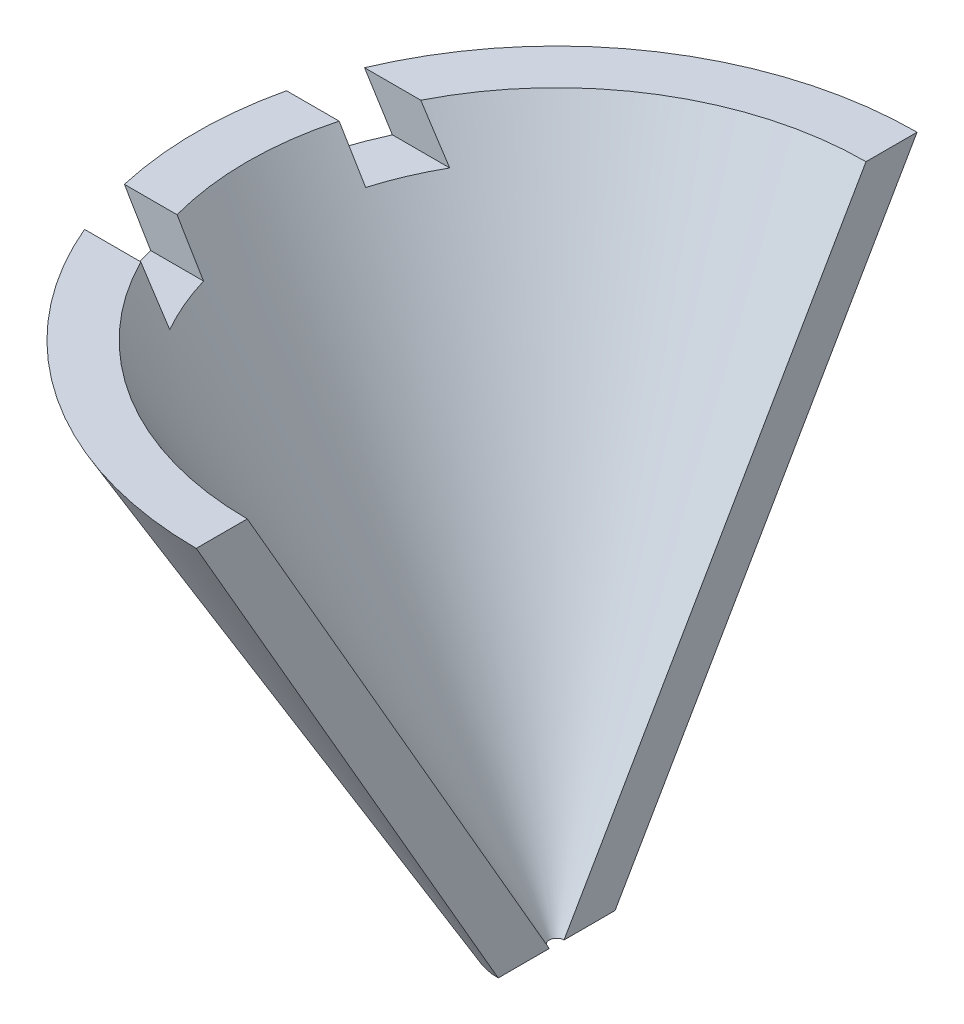
ISO-10303-21;
HEADER;
FILE_DESCRIPTION(('STEP AP214'),'2;1');
FILE_NAME('part.step','',(''),(''),'','','');
FILE_SCHEMA(('AUTOMOTIVE_DESIGN { 1 0 10303 214 1 1 1 1 }'));
ENDSEC;
DATA;
#1=APPLICATION_CONTEXT('core data for automotive mechanical design processes');
#2=APPLICATION_PROTOCOL_DEFINITION('international standard','automotive_design',2000,#1);
#3=PRODUCT_CONTEXT('',#1,'mechanical');
#4=PRODUCT('Part','Part','',(#3));
#5=PRODUCT_RELATED_PRODUCT_CATEGORY('part','',(#4));
#6=PRODUCT_DEFINITION_FORMATION('','',#4);
#7=PRODUCT_DEFINITION_CONTEXT('part definition',#1,'design');
#8=PRODUCT_DEFINITION('design','',#6,#7);
#9=PRODUCT_DEFINITION_SHAPE('','',#8);
#10=(LENGTH_UNIT() NAMED_UNIT(*) SI_UNIT(.MILLI.,.METRE.));
#11=(NAMED_UNIT(*) PLANE_ANGLE_UNIT() SI_UNIT($,.RADIAN.));
#12=(NAMED_UNIT(*) SI_UNIT($,.STERADIAN.) SOLID_ANGLE_UNIT());
#13=UNCERTAINTY_MEASURE_WITH_UNIT(LENGTH_MEASURE(1.E-05),#10,'distance_accuracy_value','');
#14=(GEOMETRIC_REPRESENTATION_CONTEXT(3) GLOBAL_UNCERTAINTY_ASSIGNED_CONTEXT((#13)) GLOBAL_UNIT_ASSIGNED_CONTEXT((#10,
#11,#12)) REPRESENTATION_CONTEXT('',''));
#15=CARTESIAN_POINT('',(0.,0.,0.));
#16=DIRECTION('',(0.,0.,1.));
#17=DIRECTION('',(1.,0.,0.));
#18=AXIS2_PLACEMENT_3D('',#15,#16,#17);
#19=CARTESIAN_POINT('',(0.,4.3242755837667,0.));
#20=DIRECTION('',(0.,1.,0.));
#21=DIRECTION('',(0.,0.,1.));
#22=AXIS2_PLACEMENT_3D('',#19,#20,#21);
#23=CONICAL_SURFACE('',#22,12.2286724799067,0.523598775598304);
#24=CARTESIAN_POINT('',(0.,2.8242755837667,0.));
#25=DIRECTION('',(0.,-1.,0.));
#26=DIRECTION('',(1.,0.,0.));
#27=AXIS2_PLACEMENT_3D('',#24,#25,#26);
#28=CIRCLE('',#27,11.3626470761223);
#29=CARTESIAN_POINT('',(-10.3221726674431,2.8242755837667,-4.75));
#30=VERTEX_POINT('',#29);
#31=CARTESIAN_POINT('',(-11.0248468731548,2.8242755837667,-2.75));
#32=VERTEX_POINT('',#31);
#33=EDGE_CURVE('E250',#30,#32,#28,.F.);
#34=ORIENTED_EDGE('',*,*,#33,.F.);
#35=CARTESIAN_POINT('',(-4.20431558511754,-5.86930909055491,-4.75));
#36=CARTESIAN_POINT('',(-4.32081574089658,-5.73552940085773,-4.75));
#37=CARTESIAN_POINT('',(-4.43580348199884,-5.60044924680136,-4.75));
#38=CARTESIAN_POINT('',(-4.66313925783365,-5.32810865166679,-4.75));
#39=CARTESIAN_POINT('',(-4.77548758327553,-5.19084845351965,-4.75));
#40=CARTESIAN_POINT('',(-4.99791169374271,-4.91459273273932,-4.75));
#41=CARTESIAN_POINT('',(-5.10798835158957,-4.77559791081223,-4.75));
#42=CARTESIAN_POINT('',(-5.32621853125392,-4.49610170065007,-4.75));
#43=CARTESIAN_POINT('',(-5.43437199157524,-4.35560026446896,-4.75));
#44=CARTESIAN_POINT('',(-5.75614417254973,-3.93245730068457,-4.75));
#45=CARTESIAN_POINT('',(-5.96727639580345,-3.64792444083813,-4.75));
#46=CARTESIAN_POINT('',(-6.38446998794349,-3.07513271587884,-4.75));
#47=CARTESIAN_POINT('',(-6.59053075865242,-2.786873417291,-4.75));
#48=CARTESIAN_POINT('',(-6.99837359501134,-2.20791442414484,-4.75));
#49=CARTESIAN_POINT('',(-7.20016092223666,-1.9172184298167,-4.75));
#50=CARTESIAN_POINT('',(-7.60052053405288,-1.3336425725848,-4.75));
#51=CARTESIAN_POINT('',(-7.79909294978434,-1.04076279947572,-4.75));
#52=CARTESIAN_POINT('',(-8.19366770777785,-0.453186386894623,-4.75));
#53=CARTESIAN_POINT('',(-8.38966947882686,-0.158489364310897,-4.75));
#54=CARTESIAN_POINT('',(-8.77951471873063,0.432330559583932,-4.75));
#55=CARTESIAN_POINT('',(-8.97335817180553,0.728453471297333,-4.75));
#56=CARTESIAN_POINT('',(-9.31265360256552,1.25023520797768,-4.75));
#57=CARTESIAN_POINT('',(-9.45848935444884,1.47564475706437,-4.75));
#58=CARTESIAN_POINT('',(-9.74923667184191,1.92704066509266,-4.75));
#59=CARTESIAN_POINT('',(-9.89414828999312,2.15302699013377,-4.75));
#60=CARTESIAN_POINT('',(-10.1831971209196,2.6055702038378,-4.75));
#61=CARTESIAN_POINT('',(-10.3273341403898,2.83212721592652,-4.75));
#62=CARTESIAN_POINT('',(-10.6148888500523,3.28570273181074,-4.75));
#63=CARTESIAN_POINT('',(-10.7583065274207,3.51272124373279,-4.75));
#64=CARTESIAN_POINT('',(-11.421258578074,4.56537830728143,-4.75));
#65=CARTESIAN_POINT('',(-11.936916938838,5.39345886802585,-4.75));
#66=CARTESIAN_POINT('',(-12.962502480222,7.05316128857481,-4.75));
#67=CARTESIAN_POINT('',(-13.4724296053369,7.88478318256857,-4.75));
#68=CARTESIAN_POINT('',(-14.4877456804525,9.54987896527475,-4.75));
#69=CARTESIAN_POINT('',(-14.9931379341389,10.3833508405818,-4.75));
#70=CARTESIAN_POINT('',(-15.7489169950837,11.6349334398041,-4.75));
#71=CARTESIAN_POINT('',(-16.0004545775747,12.0523502839229,-4.75));
#72=CARTESIAN_POINT('',(-16.5028547360984,12.8875890664591,-4.75));
#73=CARTESIAN_POINT('',(-16.7537173132692,13.305411004192,-4.75));
#74=CARTESIAN_POINT('',(-17.004288868676,13.7234074660923,-4.75));
#75=B_SPLINE_CURVE_WITH_KNOTS('',3,(#35,#36,#37,#38,#39,#40,#41,#42,#43,#44,#45,#46,#47,#48,#49,
#50,#51,#52,#53,#54,#55,#56,#57,#58,#59,#60,#61,#62,#63,#64,#65,#66,#67,#68,#69,#70,#71,#72,#73,
#74),.UNSPECIFIED.,.F.,.F.,(4,2,2,2,2,2,2,2,2,2,2,2,2,2,2,2,2,2,2,4),(0.,0.532158225419713,
1.06425756067756,1.59614849577501,2.12805640814335,3.19090257596317,4.25387351135788,
5.31544908501755,6.37698124592056,7.43874542020339,8.50051735215032,9.30593285723566,
10.1113020660841,10.916863705337,11.722439654775,14.6489294544479,17.5754475717985,
20.4996248686497,21.9616681521217,23.4237089690762),.UNSPECIFIED.);
#76=CARTESIAN_POINT('',(-11.2684484566789,4.3242755837667,-4.75));
#77=VERTEX_POINT('',#76);
#78=EDGE_CURVE('E253',#30,#77,#75,.T.);
#79=ORIENTED_EDGE('',*,*,#78,.T.);
#80=CARTESIAN_POINT('',(0.,4.3242755837667,0.));
#81=DIRECTION('',(0.,1.,0.));
#82=DIRECTION('',(0.,0.,1.));
#83=AXIS2_PLACEMENT_3D('',#80,#81,#82);
#84=CIRCLE('',#83,12.2286724799067);
#85=CARTESIAN_POINT('',(0.,4.3242755837667,-12.2286724799067));
#86=VERTEX_POINT('',#85);
#87=EDGE_CURVE('E142',#86,#77,#84,.T.);
#88=ORIENTED_EDGE('',*,*,#87,.F.);
#89=DIRECTION('',(0.,-0.866025403784436,0.500000000000005));
#90=VECTOR('',#89,1.);
#91=CARTESIAN_POINT('',(0.,4.3242755837667,-12.2286724799067));
#92=LINE('',#91,#90);
#93=CARTESIAN_POINT('',(0.,-13.4233937586586,-1.98205080756888));
#94=VERTEX_POINT('',#93);
#95=EDGE_CURVE('E176',#86,#94,#92,.T.);
#96=ORIENTED_EDGE('',*,*,#95,.T.);
#97=CARTESIAN_POINT('',(0.,-13.4233937586586,0.));
#98=DIRECTION('',(0.,1.,0.));
#99=DIRECTION('',(0.,0.,1.));
#100=AXIS2_PLACEMENT_3D('',#97,#98,#99);
#101=CIRCLE('',#100,1.98205080756888);
#102=CARTESIAN_POINT('',(0.,-13.4233937586586,1.98205080756888));
#103=VERTEX_POINT('',#102);
#104=EDGE_CURVE('E147',#94,#103,#101,.T.);
#105=ORIENTED_EDGE('',*,*,#104,.T.);
#106=DIRECTION('',(0.,-0.866025403784436,-0.500000000000005));
#107=VECTOR('',#106,1.);
#108=CARTESIAN_POINT('',(0.,4.3242755837667,12.2286724799067));
#109=LINE('',#108,#107);
#110=CARTESIAN_POINT('',(0.,4.3242755837667,12.2286724799067));
#111=VERTEX_POINT('',#110);
#112=EDGE_CURVE('E191',#111,#103,#109,.T.);
#113=ORIENTED_EDGE('',*,*,#112,.F.);
#114=CARTESIAN_POINT('',(-11.2684484566789,4.3242755837667,4.75));
#115=VERTEX_POINT('',#114);
#116=EDGE_CURVE('E177',#115,#111,#84,.T.);
#117=ORIENTED_EDGE('',*,*,#116,.F.);
#118=CARTESIAN_POINT('',(-17.004288868676,13.7234074660923,4.75));
#119=CARTESIAN_POINT('',(-16.7534803021796,13.3050156170571,4.75));
#120=CARTESIAN_POINT('',(-16.502380150979,12.8867986198587,4.75));
#121=CARTESIAN_POINT('',(-15.9995036716752,12.0507708624236,4.75));
#122=CARTESIAN_POINT('',(-15.7477273429517,11.6329601025599,4.75));
#123=CARTESIAN_POINT('',(-14.9913100570374,10.3803304177997,4.75));
#124=CARTESIAN_POINT('',(-14.4855164081606,9.54620656217624,4.75));
#125=CARTESIAN_POINT('',(-13.470263865498,7.88124793977545,4.75));
#126=CARTESIAN_POINT('',(-12.96080879014,7.05041084607032,4.75));
#127=CARTESIAN_POINT('',(-11.9361018471217,5.39214945875481,4.75));
#128=CARTESIAN_POINT('',(-11.4208491849781,4.56472565465638,4.75));
#129=CARTESIAN_POINT('',(-10.6413059223122,3.32694514032667,4.75));
#130=CARTESIAN_POINT('',(-10.3801548344904,2.91461176989171,4.75));
#131=CARTESIAN_POINT('',(-9.85524454730749,2.09161667647831,4.75));
#132=CARTESIAN_POINT('',(-9.59148539373597,1.68095492432946,4.75));
#133=CARTESIAN_POINT('',(-9.06079112507542,0.861883548616891,4.75));
#134=CARTESIAN_POINT('',(-8.7938571158964,0.45347320939445,4.75));
#135=CARTESIAN_POINT('',(-8.25580259459956,-0.360625529894516,4.75));
#136=CARTESIAN_POINT('',(-7.98468180617075,-0.766313747755254,4.75));
#137=CARTESIAN_POINT('',(-7.43663054382732,-1.57452723097612,4.75));
#138=CARTESIAN_POINT('',(-7.15969294653664,-1.97704767492108,4.75));
#139=CARTESIAN_POINT('',(-6.59852806973601,-2.77689895683473,4.75));
#140=CARTESIAN_POINT('',(-6.31430213378034,-3.1742307312042,4.75));
#141=CARTESIAN_POINT('',(-5.88008970243289,-3.76480665927496,4.75));
#142=CARTESIAN_POINT('',(-5.73394996348587,-3.96087763476962,4.75));
#143=CARTESIAN_POINT('',(-5.43856426281768,-4.35065141407676,4.75));
#144=CARTESIAN_POINT('',(-5.28931849346309,-4.54435436337628,4.75));
#145=CARTESIAN_POINT('',(-4.98695324909054,-4.92891890187214,4.75));
#146=CARTESIAN_POINT('',(-4.83383144641739,-5.11977866888758,4.75));
#147=CARTESIAN_POINT('',(-4.60063205277085,-5.40320756530355,4.75));
#148=CARTESIAN_POINT('',(-4.52230423026456,-5.49721698580023,4.75));
#149=CARTESIAN_POINT('',(-4.36433245656919,-5.68413049671222,4.75));
#150=CARTESIAN_POINT('',(-4.28468844276502,-5.77703453417748,4.75));
#151=CARTESIAN_POINT('',(-4.20431558511754,-5.86930909055491,4.75));
#152=B_SPLINE_CURVE_WITH_KNOTS('',3,(#118,#119,#120,#121,#122,#123,#124,#125,#126,#127,#128,
#129,#130,#131,#132,#133,#134,#135,#136,#137,#138,#139,#140,#141,#142,#143,#144,#145,#146,#147,
#148,#149,#150,#151),.UNSPECIFIED.,.F.,.F.,(4,2,2,2,2,2,2,2,2,2,2,2,2,2,2,2,4),(0.,
1.4634237817724,2.92684890639692,5.8533231619923,8.77709341453332,11.7012693329976,
13.1654915463544,14.6296880979479,16.0933887462459,17.5571864094123,19.0228953218217,
20.4883359563391,21.2219366904532,21.9554921247039,22.6894990483394,23.0565811387832,
23.4236807429627),.UNSPECIFIED.);
#153=CARTESIAN_POINT('',(-10.3221726674431,2.8242755837667,4.75));
#154=VERTEX_POINT('',#153);
#155=EDGE_CURVE('E197',#115,#154,#152,.T.);
#156=ORIENTED_EDGE('',*,*,#155,.T.);
#157=CARTESIAN_POINT('',(0.,2.8242755837667,0.));
#158=DIRECTION('',(0.,1.,0.));
#159=DIRECTION('',(-1.,0.,0.));
#160=AXIS2_PLACEMENT_3D('',#157,#158,#159);
#161=CIRCLE('',#160,11.3626470761223);
#162=CARTESIAN_POINT('',(-11.0248468731548,2.8242755837667,2.75));
#163=VERTEX_POINT('',#162);
#164=EDGE_CURVE('E194',#154,#163,#161,.F.);
#165=ORIENTED_EDGE('',*,*,#164,.T.);
#166=CARTESIAN_POINT('',(-17.3236025209109,13.5246585785078,2.75));
#167=CARTESIAN_POINT('',(-16.8315006241713,12.6828954524919,2.75));
#168=CARTESIAN_POINT('',(-16.33904908491,11.8413362594681,2.75));
#169=CARTESIAN_POINT('',(-15.3531403286822,10.1588170794448,2.75));
#170=CARTESIAN_POINT('',(-14.8596831204947,9.31785708730036,2.75));
#171=CARTESIAN_POINT('',(-13.8714866039281,7.63677852799145,2.75));
#172=CARTESIAN_POINT('',(-13.3767473984816,6.79665990035058,2.75));
#173=CARTESIAN_POINT('',(-12.3854347426533,5.11749383196103,2.75));
#174=CARTESIAN_POINT('',(-11.888861273954,4.27844640202281,2.75));
#175=CARTESIAN_POINT('',(-10.8930514252041,2.60180213582305,2.75));
#176=CARTESIAN_POINT('',(-10.3938147492716,1.76420547503739,2.75));
#177=CARTESIAN_POINT('',(-9.64199275719931,0.509601904048799,2.75));
#178=CARTESIAN_POINT('',(-9.39089399790374,0.091704348481427,2.75));
#179=CARTESIAN_POINT('',(-8.88743480863688,-0.743332900621203,2.75));
#180=CARTESIAN_POINT('',(-8.63507437354365,-1.16047259107043,2.75));
#181=CARTESIAN_POINT('',(-8.12871158955756,-1.99381354207558,2.75));
#182=CARTESIAN_POINT('',(-7.87470907430272,-2.41001470159796,2.75));
#183=CARTESIAN_POINT('',(-7.36458480944779,-3.24111198746512,2.75));
#184=CARTESIAN_POINT('',(-7.10846308392155,-3.65600812856098,2.75));
#185=CARTESIAN_POINT('',(-6.72210770352863,-4.27702482112185,2.75));
#186=CARTESIAN_POINT('',(-6.59295494897122,-4.4838178302123,2.75));
#187=CARTESIAN_POINT('',(-6.33379372625798,-4.89686624985235,2.75));
#188=CARTESIAN_POINT('',(-6.20378526093754,-5.10312166218011,2.75));
#189=CARTESIAN_POINT('',(-5.94274869837723,-5.51499789288879,2.75));
#190=CARTESIAN_POINT('',(-5.81172056274656,-5.72061868696516,2.75));
#191=CARTESIAN_POINT('',(-5.54842609935611,-6.13106899893081,2.75));
#192=CARTESIAN_POINT('',(-5.41615975743941,-6.33589850773509,2.75));
#193=CARTESIAN_POINT('',(-5.28316409781131,-6.54025559633771,2.75));
#194=B_SPLINE_CURVE_WITH_KNOTS('',3,(#166,#167,#168,#169,#170,#171,#172,#173,#174,#175,#176,
#177,#178,#179,#180,#181,#182,#183,#184,#185,#186,#187,#188,#189,#190,#191,#192,#193),
.UNSPECIFIED.,.F.,.F.,(4,2,2,2,2,2,2,2,2,2,2,2,2,4),(0.,2.92516118338323,5.8502969399514,
8.77520469370494,11.7001417356872,14.6254108020351,16.0880098074091,17.550614755209,
19.01337027969,20.4761092102787,21.2075404069572,21.9389691812643,22.6704256285408,
23.4018904490957),.UNSPECIFIED.);
#195=CARTESIAN_POINT('',(-11.915449241251,4.3242755837667,2.75));
#196=VERTEX_POINT('',#195);
#197=EDGE_CURVE('E236',#196,#163,#194,.T.);
#198=ORIENTED_EDGE('',*,*,#197,.F.);
#199=CARTESIAN_POINT('',(-11.915449241251,4.3242755837667,-2.75));
#200=VERTEX_POINT('',#199);
#201=EDGE_CURVE('E178',#200,#196,#84,.T.);
#202=ORIENTED_EDGE('',*,*,#201,.F.);
#203=CARTESIAN_POINT('',(-5.28316409781131,-6.54025559633771,-2.75));
#204=CARTESIAN_POINT('',(-5.46370731463167,-6.26279514714671,-2.75));
#205=CARTESIAN_POINT('',(-5.64293454124136,-5.9844847218327,-2.75));
#206=CARTESIAN_POINT('',(-5.99924924128867,-5.42650473919529,-2.75));
#207=CARTESIAN_POINT('',(-6.17633675919634,-5.14683521028842,-2.75));
#208=CARTESIAN_POINT('',(-6.52886224366619,-4.58648136306327,-2.75));
#209=CARTESIAN_POINT('',(-6.70430029863212,-4.30579710025939,-2.75));
#210=CARTESIAN_POINT('',(-7.05385622267925,-3.74360582549009,-2.75));
#211=CARTESIAN_POINT('',(-7.22797408381098,-3.46209880858462,-2.75));
#212=CARTESIAN_POINT('',(-7.74870210692284,-2.61665375509825,-2.75));
#213=CARTESIAN_POINT('',(-8.09372146981533,-2.05173621792695,-2.75));
#214=CARTESIAN_POINT('',(-8.78086808372702,-0.920137913688645,-2.75));
#215=CARTESIAN_POINT('',(-9.12299529492894,-0.353457122492778,-2.75));
#216=CARTESIAN_POINT('',(-9.62543751166933,0.482238799210627,-2.75));
#217=CARTESIAN_POINT('',(-9.78656450809473,0.750766197256553,-2.75));
#218=CARTESIAN_POINT('',(-10.108409744867,1.28806422257351,-2.75));
#219=CARTESIAN_POINT('',(-10.2691279870316,1.55683484875557,-2.75));
#220=CARTESIAN_POINT('',(-10.7507598451439,2.36347594839102,-2.75));
#221=CARTESIAN_POINT('',(-11.071143061153,2.90166310405892,-2.75));
#222=CARTESIAN_POINT('',(-11.8889013383114,4.27850106240882,-2.75));
#223=CARTESIAN_POINT('',(-12.3855053311637,5.11760964620183,-2.75));
#224=CARTESIAN_POINT('',(-13.376889315573,6.7969040451253,-2.75));
#225=CARTESIAN_POINT('',(-13.8716693051733,7.63708986141019,-2.75));
#226=CARTESIAN_POINT('',(-14.8598719368709,9.31817776578201,-2.75));
#227=CARTESIAN_POINT('',(-15.3532946740298,10.1590797980087,-2.75));
#228=CARTESIAN_POINT('',(-16.3391287686779,11.841472921381,-2.75));
#229=CARTESIAN_POINT('',(-16.8315401294418,12.6829640106075,-2.75));
#230=CARTESIAN_POINT('',(-17.3236025209109,13.5246585785078,-2.75));
#231=B_SPLINE_CURVE_WITH_KNOTS('',3,(#203,#204,#205,#206,#207,#208,#209,#210,#211,#212,#213,
#214,#215,#216,#217,#218,#219,#220,#221,#222,#223,#224,#225,#226,#227,#228,#229,#230),
.UNSPECIFIED.,.F.,.F.,(4,2,2,2,2,2,2,2,2,2,2,2,2,4),(0.,0.993075454302992,1.98613023366374,
2.97913148285842,3.97213870662016,5.95795670362993,7.94380199571098,8.88328019419876,
9.82275420713908,11.7017461137172,14.6268867543421,17.5520305323179,20.4769639334532,
23.4018878492723),.UNSPECIFIED.);
#232=EDGE_CURVE('E47',#32,#200,#231,.T.);
#233=ORIENTED_EDGE('',*,*,#232,.F.);
#234=EDGE_LOOP('',(#34,#79,#88,#96,#105,#113,#117,#156,#165,#198,#202,#233));
#235=FACE_BOUND('',#234,.T.);
#236=ADVANCED_FACE('F32',(#235),#23,.T.);
#237=CARTESIAN_POINT('',(0.,-13.4233937586586,0.));
#238=DIRECTION('',(0.,1.,0.));
#239=DIRECTION('',(0.,0.,1.));
#240=AXIS2_PLACEMENT_3D('',#237,#238,#239);
#241=CONICAL_SURFACE('',#240,0.249999999999998,0.523598775598304);
#242=CARTESIAN_POINT('',(0.,4.3242755837667,0.));
#243=DIRECTION('',(0.,1.,0.));
#244=DIRECTION('',(0.,0.,1.));
#245=AXIS2_PLACEMENT_3D('',#242,#243,#244);
#246=CIRCLE('',#245,10.4966216723378);
#247=CARTESIAN_POINT('',(0.,4.3242755837667,-10.4966216723378));
#248=VERTEX_POINT('',#247);
#249=CARTESIAN_POINT('',(-9.36037213641597,4.3242755837667,-4.75));
#250=VERTEX_POINT('',#249);
#251=EDGE_CURVE('E138',#248,#250,#246,.T.);
#252=ORIENTED_EDGE('',*,*,#251,.T.);
#253=CARTESIAN_POINT('',(-14.1621895046497,12.0161723575108,-4.75));
#254=CARTESIAN_POINT('',(-13.9583995600814,11.6815233882656,-4.75));
#255=CARTESIAN_POINT('',(-13.7542891834528,11.3470696350011,-4.75));
#256=CARTESIAN_POINT('',(-13.3453294185903,10.6786134517937,-4.75));
#257=CARTESIAN_POINT('',(-13.1404800289866,10.3446110226891,-4.75));
#258=CARTESIAN_POINT('',(-12.5247522514264,9.34349585824356,-4.75));
#259=CARTESIAN_POINT('',(-12.1126198688148,8.67715293252593,-4.75));
#260=CARTESIAN_POINT('',(-11.2845215630777,7.34821748140549,-4.75));
#261=CARTESIAN_POINT('',(-10.8685622032739,6.68562086956582,-4.75));
#262=CARTESIAN_POINT('',(-10.0304911258315,5.36412761956816,-4.75));
#263=CARTESIAN_POINT('',(-9.60837817903671,4.70523175806464,-4.75));
#264=CARTESIAN_POINT('',(-8.96818815068216,3.72039905535623,-4.75));
#265=CARTESIAN_POINT('',(-8.75337623003426,3.39234031525321,-4.75));
#266=CARTESIAN_POINT('',(-8.32106401244998,2.73800750221407,-4.75));
#267=CARTESIAN_POINT('',(-8.10356377892526,2.41173338744326,-4.75));
#268=CARTESIAN_POINT('',(-7.66534384458003,1.76158457803129,-4.75));
#269=CARTESIAN_POINT('',(-7.44462578118279,1.4377087813726,-4.75));
#270=CARTESIAN_POINT('',(-6.99898167325606,0.792814598244725,-4.75));
#271=CARTESIAN_POINT('',(-6.77405525278098,0.471796470876943,-4.75));
#272=CARTESIAN_POINT('',(-6.318365709823,-0.167035271538948,-4.75));
#273=CARTESIAN_POINT('',(-6.08759194276981,-0.484841310531039,-4.75));
#274=CARTESIAN_POINT('',(-5.6189763393129,-1.11511609856765,-4.75));
#275=CARTESIAN_POINT('',(-5.38113627636065,-1.42758615631194,-4.75));
#276=CARTESIAN_POINT('',(-5.01688972978958,-1.89083873058675,-4.75));
#277=CARTESIAN_POINT('',(-4.89411729502815,-2.04447771254068,-4.75));
#278=CARTESIAN_POINT('',(-4.64568282955776,-2.34938670707356,-4.75));
#279=CARTESIAN_POINT('',(-4.52002102714618,-2.50065690524018,-4.75));
#280=CARTESIAN_POINT('',(-4.2651353673274,-2.80039752673642,-4.75));
#281=CARTESIAN_POINT('',(-4.13590862342796,-2.9488655069751,-4.75));
#282=CARTESIAN_POINT('',(-3.93892235095382,-3.16878366637816,-4.75));
#283=CARTESIAN_POINT('',(-3.87272657218559,-3.24163558738933,-4.75));
#284=CARTESIAN_POINT('',(-3.73917438209241,-3.38627495278481,-4.75));
#285=CARTESIAN_POINT('',(-3.67181790324522,-3.45806233478586,-4.75));
#286=CARTESIAN_POINT('',(-3.6038262449697,-3.5292485353618,-4.75));
#287=B_SPLINE_CURVE_WITH_KNOTS('',3,(#253,#254,#255,#256,#257,#258,#259,#260,#261,#262,#263,
#264,#265,#266,#267,#268,#269,#270,#271,#272,#273,#274,#275,#276,#277,#278,#279,#280,#281,#282,
#283,#284,#285,#286),.UNSPECIFIED.,.F.,.F.,(4,2,2,2,2,2,2,2,2,2,2,2,2,2,2,2,4),(0.,
1.1754494383503,2.35090105687288,4.70137482825692,7.04837597102066,9.39585252297824,
10.5722353934582,11.7485905682955,12.9243667035447,14.1002483808315,15.2784511026291,
16.456360584152,17.0463343434182,17.6362616462413,18.2266815015621,18.5219727341276,
18.8172812032649),.UNSPECIFIED.);
#288=CARTESIAN_POINT('',(-8.37770162323024,2.8242755837667,-4.75));
#289=VERTEX_POINT('',#288);
#290=EDGE_CURVE('E162',#250,#289,#287,.T.);
#291=ORIENTED_EDGE('',*,*,#290,.T.);
#292=CARTESIAN_POINT('',(0.,2.8242755837667,0.));
#293=DIRECTION('',(0.,-1.,0.));
#294=DIRECTION('',(1.,0.,0.));
#295=AXIS2_PLACEMENT_3D('',#292,#293,#294);
#296=CIRCLE('',#295,9.6305962685534);
#297=CARTESIAN_POINT('',(-9.2296199535991,2.8242755837667,-2.75));
#298=VERTEX_POINT('',#297);
#299=EDGE_CURVE('E11',#298,#289,#296,.T.);
#300=ORIENTED_EDGE('',*,*,#299,.F.);
#301=CARTESIAN_POINT('',(-14.5337824702708,11.7635076431192,-2.75));
#302=CARTESIAN_POINT('',(-14.137138515903,11.0885186574751,-2.75));
#303=CARTESIAN_POINT('',(-13.7401111894217,10.4137542984925,-2.75));
#304=CARTESIAN_POINT('',(-12.9449775388643,9.06487142472058,-2.75));
#305=CARTESIAN_POINT('',(-12.5468712263342,8.39075290312397,-2.75));
#306=CARTESIAN_POINT('',(-11.7493052978454,7.04342226376549,-2.75));
#307=CARTESIAN_POINT('',(-11.3498458446909,6.37021004969103,-2.75));
#308=CARTESIAN_POINT('',(-10.5490161963715,5.02491070075863,-2.75));
#309=CARTESIAN_POINT('',(-10.1476459763583,4.35282358068619,-2.75));
#310=CARTESIAN_POINT('',(-9.34217890269084,3.01013606787029,-2.75));
#311=CARTESIAN_POINT('',(-8.93808162262158,2.33953593048938,-2.75));
#312=CARTESIAN_POINT('',(-8.32898806866793,1.33543781403036,-2.75));
#313=CARTESIAN_POINT('',(-8.12546883591389,1.0010440354447,-2.75));
#314=CARTESIAN_POINT('',(-7.71719819691804,0.333006835236898,-2.75));
#315=CARTESIAN_POINT('',(-7.51244678477192,-0.0006365827791531,-2.75));
#316=CARTESIAN_POINT('',(-7.1013664169421,-0.667017642536338,-2.75));
#317=CARTESIAN_POINT('',(-6.89503723745963,-0.999755146347694,-2.75));
#318=CARTESIAN_POINT('',(-6.4803896783405,-1.66398323079638,-2.75));
#319=CARTESIAN_POINT('',(-6.2720713256076,-1.99547382821394,-2.75));
#320=CARTESIAN_POINT('',(-5.85279236360921,-2.65683262774425,-2.75));
#321=CARTESIAN_POINT('',(-5.64183148034246,-2.98670065659235,-2.75));
#322=CARTESIAN_POINT('',(-5.32271151443994,-3.47978031760563,-2.75));
#323=CARTESIAN_POINT('',(-5.21588927307443,-3.64385688204395,-2.75));
#324=CARTESIAN_POINT('',(-5.00117636774466,-3.97131212432089,-2.75));
#325=CARTESIAN_POINT('',(-4.89328569029636,-4.13469079331447,-2.75));
#326=CARTESIAN_POINT('',(-4.78477359827199,-4.29765784160703,-2.75));
#327=B_SPLINE_CURVE_WITH_KNOTS('',3,(#301,#302,#303,#304,#305,#306,#307,#308,#309,#310,#311,
#312,#313,#314,#315,#316,#317,#318,#319,#320,#321,#322,#323,#324,#325,#326),.UNSPECIFIED.,.F.,
.F.,(4,2,2,2,2,2,2,2,2,2,2,2,4),(0.,2.34870865338432,4.69739227236475,7.04580269010602,
9.39424373111118,11.7430609100773,12.9174325582334,14.0918098381941,15.2663569077124,
16.4408881138117,17.6155421308864,18.2028960661387,18.7902574234757),.UNSPECIFIED.);
#328=CARTESIAN_POINT('',(-10.1299835405687,4.3242755837667,-2.75));
#329=VERTEX_POINT('',#328);
#330=EDGE_CURVE('E122',#329,#298,#327,.T.);
#331=ORIENTED_EDGE('',*,*,#330,.F.);
#332=CARTESIAN_POINT('',(-10.1299835405687,4.3242755837667,2.75));
#333=VERTEX_POINT('',#332);
#334=EDGE_CURVE('E55',#329,#333,#246,.T.);
#335=ORIENTED_EDGE('',*,*,#334,.T.);
#336=CARTESIAN_POINT('',(-4.78477359827199,-4.29765784160703,2.75));
#337=CARTESIAN_POINT('',(-4.95477134381392,-4.04228250576472,2.75));
#338=CARTESIAN_POINT('',(-5.12329166202145,-3.78593257951105,2.75));
#339=CARTESIAN_POINT('',(-5.4579362679686,-3.27168357501436,2.75));
#340=CARTESIAN_POINT('',(-5.62406062965661,-3.01378454493209,2.75));
#341=CARTESIAN_POINT('',(-5.95446985128532,-2.49684145076363,2.75));
#342=CARTESIAN_POINT('',(-6.11875485210854,-2.23779747652165,2.75));
#343=CARTESIAN_POINT('',(-6.44585913022679,-1.71878313456931,2.75));
#344=CARTESIAN_POINT('',(-6.60867839440184,-1.45881275859564,2.75));
#345=CARTESIAN_POINT('',(-7.09533042691746,-0.67787550728202,2.75));
#346=CARTESIAN_POINT('',(-7.41740239228177,-0.155811794404138,2.75));
#347=CARTESIAN_POINT('',(-8.05835919962108,0.890276253828794,2.75));
#348=CARTESIAN_POINT('',(-8.37724398530355,1.41430062358944,2.75));
#349=CARTESIAN_POINT('',(-8.8706051999426,2.22905474710804,2.75));
#350=CARTESIAN_POINT('',(-9.04587978672077,2.51930167637224,2.75));
#351=CARTESIAN_POINT('',(-9.3958349631762,3.1001599824471,2.75));
#352=CARTESIAN_POINT('',(-9.57051554288475,3.39077136526313,2.75));
#353=CARTESIAN_POINT('',(-10.147686337858,4.35287812413757,2.75));
#354=CARTESIAN_POINT('',(-10.5490875741121,5.02502677722699,2.75));
#355=CARTESIAN_POINT('',(-11.3499899405548,6.37045594306171,2.75));
#356=CARTESIAN_POINT('',(-11.7494910665837,7.04373645828043,2.75));
#357=CARTESIAN_POINT('',(-12.5470635643444,8.39107744779636,2.75));
#358=CARTESIAN_POINT('',(-12.9451350377979,9.06513786190246,2.75));
#359=CARTESIAN_POINT('',(-13.7401927250483,10.4138933577006,2.75));
#360=CARTESIAN_POINT('',(-14.1371789450199,11.0885884357523,2.75));
#361=CARTESIAN_POINT('',(-14.5337824702708,11.7635076431192,2.75));
#362=B_SPLINE_CURVE_WITH_KNOTS('',3,(#336,#337,#338,#339,#340,#341,#342,#343,#344,#345,#346,
#347,#348,#349,#350,#351,#352,#353,#354,#355,#356,#357,#358,#359,#360,#361),.UNSPECIFIED.,.F.,
.F.,(4,2,2,2,2,2,2,2,2,2,2,2,4),(0.,0.920333183885336,1.84063790172184,2.76087164151483,
3.68111361024571,5.52134617323306,7.3616111814957,8.37880278316944,9.39601137206417,
11.744657077095,14.093307921251,16.4417882068748,18.7902551029574),.UNSPECIFIED.);
#363=CARTESIAN_POINT('',(-9.2296199535991,2.8242755837667,2.75));
#364=VERTEX_POINT('',#363);
#365=EDGE_CURVE('E231',#364,#333,#362,.T.);
#366=ORIENTED_EDGE('',*,*,#365,.F.);
#367=CARTESIAN_POINT('',(0.,2.8242755837667,0.));
#368=DIRECTION('',(0.,1.,0.));
#369=DIRECTION('',(-1.,0.,0.));
#370=AXIS2_PLACEMENT_3D('',#367,#368,#369);
#371=CIRCLE('',#370,9.6305962685534);
#372=CARTESIAN_POINT('',(-8.37770162323024,2.8242755837667,4.75));
#373=VERTEX_POINT('',#372);
#374=EDGE_CURVE('E126',#364,#373,#371,.T.);
#375=ORIENTED_EDGE('',*,*,#374,.T.);
#376=CARTESIAN_POINT('',(-3.6038262449697,-3.5292485353618,4.75));
#377=CARTESIAN_POINT('',(-3.71945064452452,-3.40814899809581,4.75));
#378=CARTESIAN_POINT('',(-3.83326579182957,-3.285351609773,4.75));
#379=CARTESIAN_POINT('',(-4.0577433176975,-3.03694765954336,4.75));
#380=CARTESIAN_POINT('',(-4.16840630811289,-2.9113416513728,4.75));
#381=CARTESIAN_POINT('',(-4.38701754824884,-2.65794327704029,4.75));
#382=CARTESIAN_POINT('',(-4.49496754989548,-2.53015241628484,4.75));
#383=CARTESIAN_POINT('',(-4.70860234606334,-2.27268240629288,4.75));
#384=CARTESIAN_POINT('',(-4.81428701253848,-2.14300315100866,4.75));
#385=CARTESIAN_POINT('',(-5.12811619658361,-1.75199835605896,4.75));
#386=CARTESIAN_POINT('',(-5.33335061566363,-1.48833678418982,4.75));
#387=CARTESIAN_POINT('',(-5.73794804045146,-0.956493196604191,4.75));
#388=CARTESIAN_POINT('',(-5.93730987393949,-0.688310294964304,4.75));
#389=CARTESIAN_POINT('',(-6.33103383607992,-0.149109198326501,4.75));
#390=CARTESIAN_POINT('',(-6.52540497157195,0.121902433840113,4.75));
#391=CARTESIAN_POINT('',(-6.91047478488357,0.666488031245054,4.75));
#392=CARTESIAN_POINT('',(-7.10117371473052,0.940061818710734,4.75));
#393=CARTESIAN_POINT('',(-7.47966639522453,1.48933312469733,4.75));
#394=CARTESIAN_POINT('',(-7.66745923070568,1.76503127284987,4.75));
#395=CARTESIAN_POINT('',(-8.04061021644026,2.31807279651643,4.75));
#396=CARTESIAN_POINT('',(-8.22596834197605,2.59541618869184,4.75));
#397=CARTESIAN_POINT('',(-8.47507102465387,2.97109956826396,4.75));
#398=CARTESIAN_POINT('',(-8.53970595649244,3.06885051216869,4.75));
#399=CARTESIAN_POINT('',(-8.66873653808206,3.26450344735891,4.75));
#400=CARTESIAN_POINT('',(-8.73313219931562,3.36240543106844,4.75));
#401=CARTESIAN_POINT('',(-8.9260067981113,3.65636375644708,4.75));
#402=CARTESIAN_POINT('',(-9.05415145212841,3.85263942548673,4.75));
#403=CARTESIAN_POINT('',(-9.60881996952023,4.70591401577211,4.75));
#404=CARTESIAN_POINT('',(-10.0313687632817,5.36549800811607,4.75));
#405=CARTESIAN_POINT('',(-10.8703945098075,6.68852353847456,4.75));
#406=CARTESIAN_POINT('',(-11.2868713171905,7.3519651683221,4.75));
#407=CARTESIAN_POINT('',(-12.115045967312,8.68106968694842,4.75));
#408=CARTESIAN_POINT('',(-12.5267474386858,9.3467303163321,4.75));
#409=CARTESIAN_POINT('',(-13.1417848364378,10.3467372810369,4.75));
#410=CARTESIAN_POINT('',(-13.3463720333026,10.6803155196093,4.75));
#411=CARTESIAN_POINT('',(-13.7548091886522,11.3479217178298,4.75));
#412=CARTESIAN_POINT('',(-13.9586591493307,11.6819496761356,4.75));
#413=CARTESIAN_POINT('',(-14.1621895046497,12.0161723575108,4.75));
#414=B_SPLINE_CURVE_WITH_KNOTS('',3,(#376,#377,#378,#379,#380,#381,#382,#383,#384,#385,#386,
#387,#388,#389,#390,#391,#392,#393,#394,#395,#396,#397,#398,#399,#400,#401,#402,#403,#404,#405,
#406,#407,#408,#409,#410,#411,#412,#413),.UNSPECIFIED.,.F.,.F.,(4,2,2,2,2,2,2,2,2,2,2,2,2,2,2,2,
2,2,4),(0.,0.502252228320942,1.0044062927886,1.50622729281276,2.00807658342084,3.01032087585555,
4.01276388775882,5.01324845782207,6.01366411707034,7.01438865901132,8.01512335266372,
8.36668581940039,8.71823119102887,9.42144086500651,11.771358747067,14.1213328010248,
16.4693856561315,17.6433412527664,18.8172933531644),.UNSPECIFIED.);
#415=CARTESIAN_POINT('',(-9.36037213641598,4.3242755837667,4.75));
#416=VERTEX_POINT('',#415);
#417=EDGE_CURVE('E205',#373,#416,#414,.T.);
#418=ORIENTED_EDGE('',*,*,#417,.T.);
#419=CARTESIAN_POINT('',(0.,4.3242755837667,10.4966216723378));
#420=VERTEX_POINT('',#419);
#421=EDGE_CURVE('E139',#416,#420,#246,.T.);
#422=ORIENTED_EDGE('',*,*,#421,.T.);
#423=DIRECTION('',(0.,0.866025403784436,0.500000000000004));
#424=VECTOR('',#423,1.);
#425=CARTESIAN_POINT('',(0.,4.3242755837667,10.4966216723378));
#426=LINE('',#425,#424);
#427=CARTESIAN_POINT('',(0.,-13.4233937586586,0.249999999999998));
#428=VERTEX_POINT('',#427);
#429=EDGE_CURVE('E185',#428,#420,#426,.T.);
#430=ORIENTED_EDGE('',*,*,#429,.F.);
#431=CARTESIAN_POINT('',(0.,-13.4233937586586,0.));
#432=DIRECTION('',(0.,1.,0.));
#433=DIRECTION('',(0.,0.,1.));
#434=AXIS2_PLACEMENT_3D('',#431,#432,#433);
#435=CIRCLE('',#434,0.249999999999998);
#436=CARTESIAN_POINT('',(0.,-13.4233937586586,-0.249999999999998));
#437=VERTEX_POINT('',#436);
#438=EDGE_CURVE('E141',#437,#428,#435,.T.);
#439=ORIENTED_EDGE('',*,*,#438,.F.);
#440=DIRECTION('',(0.,0.866025403784436,-0.500000000000004));
#441=VECTOR('',#440,1.);
#442=CARTESIAN_POINT('',(0.,4.3242755837667,-10.4966216723378));
#443=LINE('',#442,#441);
#444=EDGE_CURVE('E164',#437,#248,#443,.T.);
#445=ORIENTED_EDGE('',*,*,#444,.T.);
#446=EDGE_LOOP('',(#252,#291,#300,#331,#335,#366,#375,#418,#422,#430,#439,#445));
#447=FACE_BOUND('',#446,.T.);
#448=ADVANCED_FACE('F130',(#447),#241,.F.);
#449=CARTESIAN_POINT('',(0.,4.3242755837667,-10.4966216723378));
#450=DIRECTION('',(0.,1.,0.));
#451=DIRECTION('',(0.,0.,1.));
#452=AXIS2_PLACEMENT_3D('',#449,#450,#451);
#453=PLANE('',#452);
#454=ORIENTED_EDGE('',*,*,#87,.T.);
#455=DIRECTION('',(1.,0.,0.));
#456=VECTOR('',#455,1.);
#457=CARTESIAN_POINT('',(0.,4.3242755837667,-4.75));
#458=LINE('',#457,#456);
#459=EDGE_CURVE('E40',#77,#250,#458,.T.);
#460=ORIENTED_EDGE('',*,*,#459,.T.);
#461=ORIENTED_EDGE('',*,*,#251,.F.);
#462=DIRECTION('',(0.,0.,-1.));
#463=VECTOR('',#462,1.);
#464=CARTESIAN_POINT('',(0.,4.3242755837667,-10.4966216723378));
#465=LINE('',#464,#463);
#466=EDGE_CURVE('E170',#248,#86,#465,.T.);
#467=ORIENTED_EDGE('',*,*,#466,.T.);
#468=EDGE_LOOP('',(#454,#460,#461,#467));
#469=FACE_BOUND('',#468,.T.);
#470=ADVANCED_FACE('F157',(#469),#453,.T.);
#471=ORIENTED_EDGE('',*,*,#421,.F.);
#472=DIRECTION('',(-1.,0.,0.));
#473=VECTOR('',#472,1.);
#474=CARTESIAN_POINT('',(0.,4.3242755837667,4.75));
#475=LINE('',#474,#473);
#476=EDGE_CURVE('E150',#416,#115,#475,.T.);
#477=ORIENTED_EDGE('',*,*,#476,.T.);
#478=ORIENTED_EDGE('',*,*,#116,.T.);
#479=DIRECTION('',(0.,0.,1.));
#480=VECTOR('',#479,1.);
#481=CARTESIAN_POINT('',(0.,4.3242755837667,10.4966216723378));
#482=LINE('',#481,#480);
#483=EDGE_CURVE('E182',#420,#111,#482,.T.);
#484=ORIENTED_EDGE('',*,*,#483,.F.);
#485=EDGE_LOOP('',(#471,#477,#478,#484));
#486=FACE_BOUND('',#485,.T.);
#487=ADVANCED_FACE('F285',(#486),#453,.T.);
#488=CARTESIAN_POINT('',(0.,-13.4233937586586,-1.98205080756888));
#489=DIRECTION('',(0.,-1.,0.));
#490=DIRECTION('',(0.,0.,-1.));
#491=AXIS2_PLACEMENT_3D('',#488,#489,#490);
#492=PLANE('',#491);
#493=ORIENTED_EDGE('',*,*,#438,.T.);
#494=DIRECTION('',(0.,0.,-1.));
#495=VECTOR('',#494,1.);
#496=CARTESIAN_POINT('',(0.,-13.4233937586586,1.98205080756888));
#497=LINE('',#496,#495);
#498=EDGE_CURVE('E188',#103,#428,#497,.T.);
#499=ORIENTED_EDGE('',*,*,#498,.F.);
#500=ORIENTED_EDGE('',*,*,#104,.F.);
#501=DIRECTION('',(0.,0.,1.));
#502=VECTOR('',#501,1.);
#503=CARTESIAN_POINT('',(0.,-13.4233937586586,-1.98205080756888));
#504=LINE('',#503,#502);
#505=EDGE_CURVE('E171',#94,#437,#504,.T.);
#506=ORIENTED_EDGE('',*,*,#505,.T.);
#507=EDGE_LOOP('',(#493,#499,#500,#506));
#508=FACE_BOUND('',#507,.T.);
#509=ADVANCED_FACE('F34',(#508),#492,.T.);
#510=DIRECTION('',(1.,0.,0.));
#511=VECTOR('',#510,1.);
#512=CARTESIAN_POINT('',(0.,4.3242755837667,-2.75));
#513=LINE('',#512,#511);
#514=EDGE_CURVE('E120',#200,#329,#513,.T.);
#515=ORIENTED_EDGE('',*,*,#514,.F.);
#516=ORIENTED_EDGE('',*,*,#201,.T.);
#517=DIRECTION('',(-1.,0.,0.));
#518=VECTOR('',#517,1.);
#519=CARTESIAN_POINT('',(0.,4.3242755837667,2.75));
#520=LINE('',#519,#518);
#521=EDGE_CURVE('E137',#333,#196,#520,.T.);
#522=ORIENTED_EDGE('',*,*,#521,.F.);
#523=ORIENTED_EDGE('',*,*,#334,.F.);
#524=EDGE_LOOP('',(#515,#516,#522,#523));
#525=FACE_BOUND('',#524,.T.);
#526=ADVANCED_FACE('F135',(#525),#453,.T.);
#527=CARTESIAN_POINT('',(0.,0.,0.));
#528=DIRECTION('',(-1.,0.,0.));
#529=DIRECTION('',(0.,0.,1.));
#530=AXIS2_PLACEMENT_3D('',#527,#528,#529);
#531=PLANE('',#530);
#532=ORIENTED_EDGE('',*,*,#95,.F.);
#533=ORIENTED_EDGE('',*,*,#466,.F.);
#534=ORIENTED_EDGE('',*,*,#444,.F.);
#535=ORIENTED_EDGE('',*,*,#505,.F.);
#536=EDGE_LOOP('',(#532,#533,#534,#535));
#537=FACE_BOUND('',#536,.T.);
#538=ADVANCED_FACE('F174',(#537),#531,.F.);
#539=CARTESIAN_POINT('',(0.,0.,0.));
#540=DIRECTION('',(1.,0.,0.));
#541=DIRECTION('',(0.,0.,-1.));
#542=AXIS2_PLACEMENT_3D('',#539,#540,#541);
#543=PLANE('',#542);
#544=ORIENTED_EDGE('',*,*,#112,.T.);
#545=ORIENTED_EDGE('',*,*,#498,.T.);
#546=ORIENTED_EDGE('',*,*,#429,.T.);
#547=ORIENTED_EDGE('',*,*,#483,.T.);
#548=EDGE_LOOP('',(#544,#545,#546,#547));
#549=FACE_BOUND('',#548,.T.);
#550=ADVANCED_FACE('F290',(#549),#543,.T.);
#551=CARTESIAN_POINT('',(-5.91544924125097,2.8242755837667,4.75));
#552=DIRECTION('',(0.,1.,0.));
#553=DIRECTION('',(-1.,0.,0.));
#554=AXIS2_PLACEMENT_3D('',#551,#552,#553);
#555=PLANE('',#554);
#556=DIRECTION('',(1.,0.,0.));
#557=VECTOR('',#556,1.);
#558=CARTESIAN_POINT('',(-5.91544924125097,2.8242755837667,4.75));
#559=LINE('',#558,#557);
#560=EDGE_CURVE('E244',#154,#373,#559,.T.);
#561=ORIENTED_EDGE('',*,*,#560,.T.);
#562=ORIENTED_EDGE('',*,*,#374,.F.);
#563=DIRECTION('',(1.,0.,0.));
#564=VECTOR('',#563,1.);
#565=CARTESIAN_POINT('',(-5.91544924125097,2.8242755837667,2.75));
#566=LINE('',#565,#564);
#567=EDGE_CURVE('E246',#163,#364,#566,.T.);
#568=ORIENTED_EDGE('',*,*,#567,.F.);
#569=ORIENTED_EDGE('',*,*,#164,.F.);
#570=EDGE_LOOP('',(#561,#562,#568,#569));
#571=FACE_BOUND('',#570,.T.);
#572=ADVANCED_FACE('F219',(#571),#555,.T.);
#573=CARTESIAN_POINT('',(0.,0.,4.75));
#574=DIRECTION('',(0.,0.,-1.));
#575=DIRECTION('',(-1.,0.,0.));
#576=AXIS2_PLACEMENT_3D('',#573,#574,#575);
#577=PLANE('',#576);
#578=ORIENTED_EDGE('',*,*,#476,.F.);
#579=ORIENTED_EDGE('',*,*,#417,.F.);
#580=ORIENTED_EDGE('',*,*,#560,.F.);
#581=ORIENTED_EDGE('',*,*,#155,.F.);
#582=EDGE_LOOP('',(#578,#579,#580,#581));
#583=FACE_BOUND('',#582,.T.);
#584=ADVANCED_FACE('F213',(#583),#577,.T.);
#585=CARTESIAN_POINT('',(0.,0.,2.75));
#586=DIRECTION('',(0.,0.,-1.));
#587=DIRECTION('',(-1.,0.,0.));
#588=AXIS2_PLACEMENT_3D('',#585,#586,#587);
#589=PLANE('',#588);
#590=ORIENTED_EDGE('',*,*,#197,.T.);
#591=ORIENTED_EDGE('',*,*,#567,.T.);
#592=ORIENTED_EDGE('',*,*,#365,.T.);
#593=ORIENTED_EDGE('',*,*,#521,.T.);
#594=EDGE_LOOP('',(#590,#591,#592,#593));
#595=FACE_BOUND('',#594,.T.);
#596=ADVANCED_FACE('F218',(#595),#589,.F.);
#597=CARTESIAN_POINT('',(-5.91544924125097,2.8242755837667,-4.75));
#598=DIRECTION('',(0.,-1.,0.));
#599=DIRECTION('',(1.,0.,0.));
#600=AXIS2_PLACEMENT_3D('',#597,#598,#599);
#601=PLANE('',#600);
#602=ORIENTED_EDGE('',*,*,#33,.T.);
#603=DIRECTION('',(1.,0.,0.));
#604=VECTOR('',#603,1.);
#605=CARTESIAN_POINT('',(-5.91544924125097,2.8242755837667,-2.75));
#606=LINE('',#605,#604);
#607=EDGE_CURVE('E277',#32,#298,#606,.T.);
#608=ORIENTED_EDGE('',*,*,#607,.T.);
#609=ORIENTED_EDGE('',*,*,#299,.T.);
#610=DIRECTION('',(1.,0.,0.));
#611=VECTOR('',#610,1.);
#612=CARTESIAN_POINT('',(-5.91544924125097,2.8242755837667,-4.75));
#613=LINE('',#612,#611);
#614=EDGE_CURVE('E132',#30,#289,#613,.T.);
#615=ORIENTED_EDGE('',*,*,#614,.F.);
#616=EDGE_LOOP('',(#602,#608,#609,#615));
#617=FACE_BOUND('',#616,.T.);
#618=ADVANCED_FACE('F221',(#617),#601,.F.);
#619=CARTESIAN_POINT('',(0.,0.,-4.75));
#620=DIRECTION('',(0.,0.,1.));
#621=DIRECTION('',(-1.,0.,0.));
#622=AXIS2_PLACEMENT_3D('',#619,#620,#621);
#623=PLANE('',#622);
#624=ORIENTED_EDGE('',*,*,#614,.T.);
#625=ORIENTED_EDGE('',*,*,#290,.F.);
#626=ORIENTED_EDGE('',*,*,#459,.F.);
#627=ORIENTED_EDGE('',*,*,#78,.F.);
#628=EDGE_LOOP('',(#624,#625,#626,#627));
#629=FACE_BOUND('',#628,.T.);
#630=ADVANCED_FACE('F263',(#629),#623,.T.);
#631=CARTESIAN_POINT('',(0.,0.,-2.75));
#632=DIRECTION('',(0.,0.,1.));
#633=DIRECTION('',(-1.,0.,0.));
#634=AXIS2_PLACEMENT_3D('',#631,#632,#633);
#635=PLANE('',#634);
#636=ORIENTED_EDGE('',*,*,#232,.T.);
#637=ORIENTED_EDGE('',*,*,#514,.T.);
#638=ORIENTED_EDGE('',*,*,#330,.T.);
#639=ORIENTED_EDGE('',*,*,#607,.F.);
#640=EDGE_LOOP('',(#636,#637,#638,#639));
#641=FACE_BOUND('',#640,.T.);
#642=ADVANCED_FACE('F121',(#641),#635,.F.);
#643=CLOSED_SHELL('',(#236,#448,#470,#487,#509,#526,#538,#550,#572,#584,#596,#618,#630,#642));
#644=MANIFOLD_SOLID_BREP('B2',#643);
#645=ADVANCED_BREP_SHAPE_REPRESENTATION('',(#18,#644),#14);
#646=SHAPE_DEFINITION_REPRESENTATION(#9,#645);
ENDSEC;
END-ISO-10303-21;
